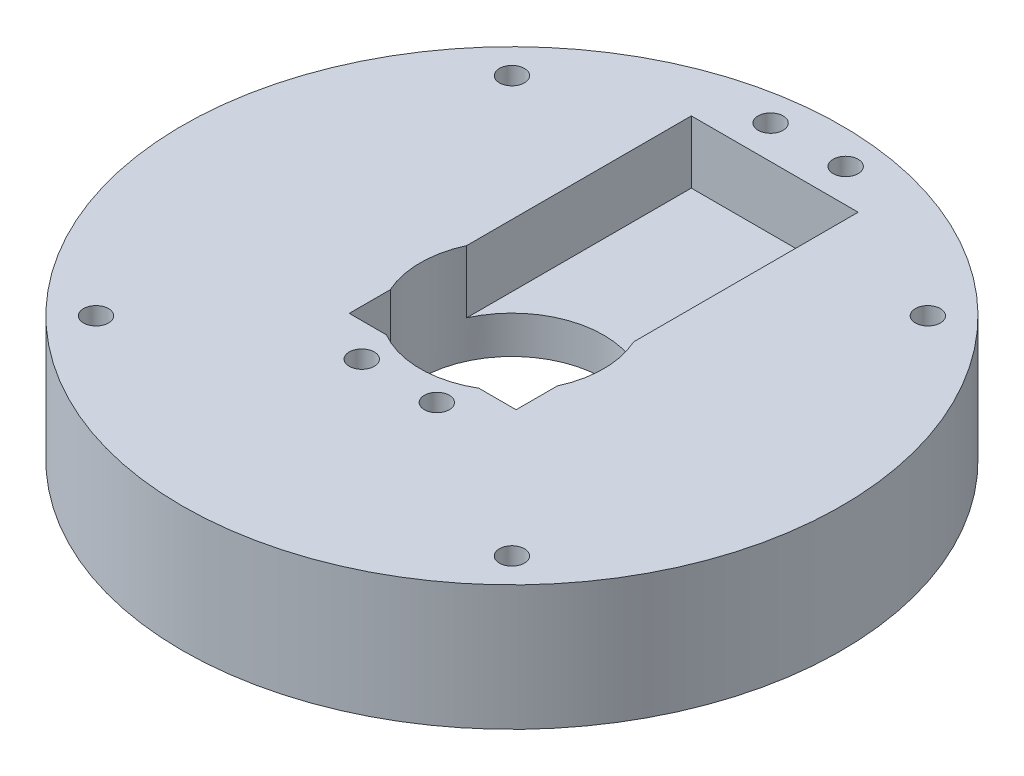
ISO-10303-21;
HEADER;
FILE_DESCRIPTION(('STEP AP214'),'2;1');
FILE_NAME('part.step','',(''),(''),'','','');
FILE_SCHEMA(('AUTOMOTIVE_DESIGN { 1 0 10303 214 1 1 1 1 }'));
ENDSEC;
DATA;
#1=APPLICATION_CONTEXT('core data for automotive mechanical design processes');
#2=APPLICATION_PROTOCOL_DEFINITION('international standard','automotive_design',2000,#1);
#3=PRODUCT_CONTEXT('',#1,'mechanical');
#4=PRODUCT('Part','Part','',(#3));
#5=PRODUCT_RELATED_PRODUCT_CATEGORY('part','',(#4));
#6=PRODUCT_DEFINITION_FORMATION('','',#4);
#7=PRODUCT_DEFINITION_CONTEXT('part definition',#1,'design');
#8=PRODUCT_DEFINITION('design','',#6,#7);
#9=PRODUCT_DEFINITION_SHAPE('','',#8);
#10=(LENGTH_UNIT() NAMED_UNIT(*) SI_UNIT(.MILLI.,.METRE.));
#11=(NAMED_UNIT(*) PLANE_ANGLE_UNIT() SI_UNIT($,.RADIAN.));
#12=(NAMED_UNIT(*) SI_UNIT($,.STERADIAN.) SOLID_ANGLE_UNIT());
#13=UNCERTAINTY_MEASURE_WITH_UNIT(LENGTH_MEASURE(1.E-05),#10,'distance_accuracy_value','');
#14=(GEOMETRIC_REPRESENTATION_CONTEXT(3) GLOBAL_UNCERTAINTY_ASSIGNED_CONTEXT((#13)) GLOBAL_UNIT_ASSIGNED_CONTEXT((#10,
#11,#12)) REPRESENTATION_CONTEXT('',''));
#15=CARTESIAN_POINT('',(0.,0.,0.));
#16=DIRECTION('',(0.,0.,1.));
#17=DIRECTION('',(1.,0.,0.));
#18=AXIS2_PLACEMENT_3D('',#15,#16,#17);
#19=CARTESIAN_POINT('',(0.,15.,0.));
#20=DIRECTION('',(0.,-1.,0.));
#21=DIRECTION('',(0.,0.,-1.));
#22=AXIS2_PLACEMENT_3D('',#19,#20,#21);
#23=CYLINDRICAL_SURFACE('',#22,11.);
#24=DIRECTION('',(0.,-1.,0.));
#25=VECTOR('',#24,1.);
#26=CARTESIAN_POINT('',(9.99999999999999,15.,4.58257569495585));
#27=LINE('',#26,#25);
#28=CARTESIAN_POINT('',(9.99999999999999,15.,4.58257569495585));
#29=VERTEX_POINT('',#28);
#30=CARTESIAN_POINT('',(9.99999999999999,7.5,4.58257569495585));
#31=VERTEX_POINT('',#30);
#32=EDGE_CURVE('E11',#29,#31,#27,.T.);
#33=ORIENTED_EDGE('',*,*,#32,.F.);
#34=CARTESIAN_POINT('',(0.,15.,0.));
#35=DIRECTION('',(0.,1.,0.));
#36=DIRECTION('',(0.,0.,1.));
#37=AXIS2_PLACEMENT_3D('',#34,#35,#36);
#38=CIRCLE('',#37,11.);
#39=CARTESIAN_POINT('',(9.99999999999999,15.,-4.58257569495585));
#40=VERTEX_POINT('',#39);
#41=EDGE_CURVE('E185',#29,#40,#38,.T.);
#42=ORIENTED_EDGE('',*,*,#41,.T.);
#43=DIRECTION('',(0.,-1.,0.));
#44=VECTOR('',#43,1.);
#45=CARTESIAN_POINT('',(9.99999999999999,15.,-4.58257569495585));
#46=LINE('',#45,#44);
#47=CARTESIAN_POINT('',(9.99999999999999,7.5,-4.58257569495585));
#48=VERTEX_POINT('',#47);
#49=EDGE_CURVE('E198',#48,#40,#46,.F.);
#50=ORIENTED_EDGE('',*,*,#49,.F.);
#51=CARTESIAN_POINT('',(0.,7.5,0.));
#52=DIRECTION('',(0.,-1.,0.));
#53=DIRECTION('',(0.,0.,-1.));
#54=AXIS2_PLACEMENT_3D('',#51,#52,#53);
#55=CIRCLE('',#54,11.);
#56=CARTESIAN_POINT('',(-10.,7.5,-4.58257569495583));
#57=VERTEX_POINT('',#56);
#58=EDGE_CURVE('E116',#57,#48,#55,.T.);
#59=ORIENTED_EDGE('',*,*,#58,.F.);
#60=DIRECTION('',(0.,-1.,0.));
#61=VECTOR('',#60,1.);
#62=CARTESIAN_POINT('',(-10.,15.,-4.58257569495583));
#63=LINE('',#62,#61);
#64=CARTESIAN_POINT('',(-10.,15.,-4.58257569495583));
#65=VERTEX_POINT('',#64);
#66=EDGE_CURVE('E193',#65,#57,#63,.T.);
#67=ORIENTED_EDGE('',*,*,#66,.F.);
#68=CARTESIAN_POINT('',(-10.,15.,4.58257569495583));
#69=VERTEX_POINT('',#68);
#70=EDGE_CURVE('E184',#65,#69,#38,.T.);
#71=ORIENTED_EDGE('',*,*,#70,.T.);
#72=DIRECTION('',(0.,-1.,0.));
#73=VECTOR('',#72,1.);
#74=CARTESIAN_POINT('',(-10.,15.,4.58257569495583));
#75=LINE('',#74,#73);
#76=CARTESIAN_POINT('',(-10.,7.5,4.58257569495583));
#77=VERTEX_POINT('',#76);
#78=EDGE_CURVE('E200',#77,#69,#75,.F.);
#79=ORIENTED_EDGE('',*,*,#78,.F.);
#80=CARTESIAN_POINT('',(-5.54526825320471,7.5,9.5));
#81=VERTEX_POINT('',#80);
#82=EDGE_CURVE('E195',#81,#77,#55,.T.);
#83=ORIENTED_EDGE('',*,*,#82,.F.);
#84=DIRECTION('',(0.,-1.,0.));
#85=VECTOR('',#84,1.);
#86=CARTESIAN_POINT('',(-5.54526825320471,15.,9.5));
#87=LINE('',#86,#85);
#88=CARTESIAN_POINT('',(-5.54526825320471,15.,9.5));
#89=VERTEX_POINT('',#88);
#90=EDGE_CURVE('E202',#89,#81,#87,.T.);
#91=ORIENTED_EDGE('',*,*,#90,.F.);
#92=CARTESIAN_POINT('',(5.54526825320471,15.,9.5));
#93=VERTEX_POINT('',#92);
#94=EDGE_CURVE('E179',#89,#93,#38,.T.);
#95=ORIENTED_EDGE('',*,*,#94,.T.);
#96=DIRECTION('',(0.,-1.,0.));
#97=VECTOR('',#96,1.);
#98=CARTESIAN_POINT('',(5.54526825320471,15.,9.5));
#99=LINE('',#98,#97);
#100=CARTESIAN_POINT('',(5.54526825320471,7.5,9.5));
#101=VERTEX_POINT('',#100);
#102=EDGE_CURVE('E42',#101,#93,#99,.F.);
#103=ORIENTED_EDGE('',*,*,#102,.F.);
#104=EDGE_CURVE('E194',#31,#101,#55,.T.);
#105=ORIENTED_EDGE('',*,*,#104,.F.);
#106=EDGE_LOOP('',(#33,#42,#50,#59,#67,#71,#79,#83,#91,#95,#103,#105));
#107=FACE_BOUND('',#106,.T.);
#108=CARTESIAN_POINT('',(0.,3.,0.));
#109=DIRECTION('',(0.,-1.,0.));
#110=DIRECTION('',(0.,0.,-1.));
#111=AXIS2_PLACEMENT_3D('',#108,#109,#110);
#112=CIRCLE('',#111,11.);
#113=CARTESIAN_POINT('',(0.,3.,-11.));
#114=VERTEX_POINT('',#113);
#115=EDGE_CURVE('E254',#114,#114,#112,.T.);
#116=ORIENTED_EDGE('',*,*,#115,.T.);
#117=EDGE_LOOP('',(#116));
#118=FACE_BOUND('',#117,.T.);
#119=ADVANCED_FACE('F33',(#107,#118),#23,.F.);
#120=CARTESIAN_POINT('',(-4.49999999999999,7.5,13.5));
#121=DIRECTION('',(0.,1.,0.));
#122=DIRECTION('',(0.,0.,1.));
#123=AXIS2_PLACEMENT_3D('',#120,#121,#122);
#124=CYLINDRICAL_SURFACE('',#123,1.5);
#125=CARTESIAN_POINT('',(-4.49999999999999,15.,13.5));
#126=DIRECTION('',(0.,1.,0.));
#127=DIRECTION('',(0.,0.,1.));
#128=AXIS2_PLACEMENT_3D('',#125,#126,#127);
#129=CIRCLE('',#128,1.5);
#130=CARTESIAN_POINT('',(-4.49999999999999,15.,15.));
#131=VERTEX_POINT('',#130);
#132=EDGE_CURVE('E231',#131,#131,#129,.T.);
#133=ORIENTED_EDGE('',*,*,#132,.T.);
#134=EDGE_LOOP('',(#133));
#135=FACE_BOUND('',#134,.T.);
#136=CARTESIAN_POINT('',(-4.49999999999999,3.,13.5));
#137=DIRECTION('',(0.,-1.,0.));
#138=DIRECTION('',(0.,0.,-1.));
#139=AXIS2_PLACEMENT_3D('',#136,#137,#138);
#140=CIRCLE('',#139,1.5);
#141=CARTESIAN_POINT('',(-4.49999999999999,3.,12.));
#142=VERTEX_POINT('',#141);
#143=EDGE_CURVE('E258',#142,#142,#140,.F.);
#144=ORIENTED_EDGE('',*,*,#143,.F.);
#145=EDGE_LOOP('',(#144));
#146=FACE_BOUND('',#145,.T.);
#147=ADVANCED_FACE('F278',(#135,#146),#124,.F.);
#148=CARTESIAN_POINT('',(4.5,7.5,13.5));
#149=DIRECTION('',(0.,1.,0.));
#150=DIRECTION('',(0.,0.,1.));
#151=AXIS2_PLACEMENT_3D('',#148,#149,#150);
#152=CYLINDRICAL_SURFACE('',#151,1.5);
#153=CARTESIAN_POINT('',(4.5,15.,13.5));
#154=DIRECTION('',(0.,1.,0.));
#155=DIRECTION('',(0.,0.,1.));
#156=AXIS2_PLACEMENT_3D('',#153,#154,#155);
#157=CIRCLE('',#156,1.5);
#158=CARTESIAN_POINT('',(4.5,15.,15.));
#159=VERTEX_POINT('',#158);
#160=EDGE_CURVE('E233',#159,#159,#157,.T.);
#161=ORIENTED_EDGE('',*,*,#160,.T.);
#162=EDGE_LOOP('',(#161));
#163=FACE_BOUND('',#162,.T.);
#164=CARTESIAN_POINT('',(4.5,3.,13.5));
#165=DIRECTION('',(0.,-1.,0.));
#166=DIRECTION('',(0.,0.,-1.));
#167=AXIS2_PLACEMENT_3D('',#164,#165,#166);
#168=CIRCLE('',#167,1.5);
#169=CARTESIAN_POINT('',(4.5,3.,12.));
#170=VERTEX_POINT('',#169);
#171=EDGE_CURVE('E37',#170,#170,#168,.F.);
#172=ORIENTED_EDGE('',*,*,#171,.F.);
#173=EDGE_LOOP('',(#172));
#174=FACE_BOUND('',#173,.T.);
#175=ADVANCED_FACE('F276',(#163,#174),#152,.F.);
#176=CARTESIAN_POINT('',(0.,15.,0.));
#177=DIRECTION('',(0.,1.,0.));
#178=DIRECTION('',(0.,0.,1.));
#179=AXIS2_PLACEMENT_3D('',#176,#177,#178);
#180=PLANE('',#179);
#181=CARTESIAN_POINT('',(-4.5,15.,-35.5));
#182=DIRECTION('',(0.,1.,0.));
#183=DIRECTION('',(0.,0.,1.));
#184=AXIS2_PLACEMENT_3D('',#181,#182,#183);
#185=CIRCLE('',#184,1.5);
#186=CARTESIAN_POINT('',(-4.5,15.,-34.));
#187=VERTEX_POINT('',#186);
#188=EDGE_CURVE('E245',#187,#187,#185,.T.);
#189=ORIENTED_EDGE('',*,*,#188,.F.);
#190=EDGE_LOOP('',(#189));
#191=FACE_BOUND('',#190,.T.);
#192=CARTESIAN_POINT('',(4.5,15.,-35.5));
#193=DIRECTION('',(0.,1.,0.));
#194=DIRECTION('',(0.,0.,1.));
#195=AXIS2_PLACEMENT_3D('',#192,#193,#194);
#196=CIRCLE('',#195,1.5);
#197=CARTESIAN_POINT('',(4.5,15.,-34.));
#198=VERTEX_POINT('',#197);
#199=EDGE_CURVE('E238',#198,#198,#196,.T.);
#200=ORIENTED_EDGE('',*,*,#199,.F.);
#201=EDGE_LOOP('',(#200));
#202=FACE_BOUND('',#201,.T.);
#203=ORIENTED_EDGE('',*,*,#160,.F.);
#204=EDGE_LOOP('',(#203));
#205=FACE_BOUND('',#204,.T.);
#206=ORIENTED_EDGE('',*,*,#132,.F.);
#207=EDGE_LOOP('',(#206));
#208=FACE_BOUND('',#207,.T.);
#209=DIRECTION('',(0.,0.,-1.));
#210=VECTOR('',#209,1.);
#211=CARTESIAN_POINT('',(9.99999999999999,15.,9.5));
#212=LINE('',#211,#210);
#213=CARTESIAN_POINT('',(9.99999999999999,15.,9.5));
#214=VERTEX_POINT('',#213);
#215=EDGE_CURVE('E141',#214,#29,#212,.T.);
#216=ORIENTED_EDGE('',*,*,#215,.F.);
#217=DIRECTION('',(1.,0.,0.));
#218=VECTOR('',#217,1.);
#219=CARTESIAN_POINT('',(-10.,15.,9.5));
#220=LINE('',#219,#218);
#221=EDGE_CURVE('E148',#93,#214,#220,.T.);
#222=ORIENTED_EDGE('',*,*,#221,.F.);
#223=ORIENTED_EDGE('',*,*,#94,.F.);
#224=CARTESIAN_POINT('',(-10.,15.,9.5));
#225=VERTEX_POINT('',#224);
#226=EDGE_CURVE('E119',#225,#89,#220,.T.);
#227=ORIENTED_EDGE('',*,*,#226,.F.);
#228=DIRECTION('',(0.,0.,1.));
#229=VECTOR('',#228,1.);
#230=CARTESIAN_POINT('',(-10.,15.,9.5));
#231=LINE('',#230,#229);
#232=EDGE_CURVE('E145',#69,#225,#231,.T.);
#233=ORIENTED_EDGE('',*,*,#232,.F.);
#234=ORIENTED_EDGE('',*,*,#70,.F.);
#235=CARTESIAN_POINT('',(-10.,15.,-31.5));
#236=VERTEX_POINT('',#235);
#237=EDGE_CURVE('E146',#236,#65,#231,.T.);
#238=ORIENTED_EDGE('',*,*,#237,.F.);
#239=DIRECTION('',(-1.,0.,0.));
#240=VECTOR('',#239,1.);
#241=CARTESIAN_POINT('',(-10.,15.,-31.5));
#242=LINE('',#241,#240);
#243=CARTESIAN_POINT('',(9.99999999999999,15.,-31.5));
#244=VERTEX_POINT('',#243);
#245=EDGE_CURVE('E143',#244,#236,#242,.T.);
#246=ORIENTED_EDGE('',*,*,#245,.F.);
#247=EDGE_CURVE('E125',#40,#244,#212,.T.);
#248=ORIENTED_EDGE('',*,*,#247,.F.);
#249=ORIENTED_EDGE('',*,*,#41,.F.);
#250=EDGE_LOOP('',(#216,#222,#223,#227,#233,#234,#238,#246,#248,#249));
#251=FACE_BOUND('',#250,.T.);
#252=CARTESIAN_POINT('',(-24.9255140368244,15.,24.9255140368272));
#253=DIRECTION('',(0.,1.,0.));
#254=DIRECTION('',(0.,0.,1.));
#255=AXIS2_PLACEMENT_3D('',#252,#253,#254);
#256=CIRCLE('',#255,1.50000000000104);
#257=CARTESIAN_POINT('',(-24.9255140368244,15.,26.4255140368283));
#258=VERTEX_POINT('',#257);
#259=EDGE_CURVE('E164',#258,#258,#256,.T.);
#260=ORIENTED_EDGE('',*,*,#259,.F.);
#261=EDGE_LOOP('',(#260));
#262=FACE_BOUND('',#261,.T.);
#263=CARTESIAN_POINT('',(24.9255140368257,15.,-24.9255140368258));
#264=DIRECTION('',(0.,1.,0.));
#265=DIRECTION('',(0.,0.,1.));
#266=AXIS2_PLACEMENT_3D('',#263,#264,#265);
#267=CIRCLE('',#266,1.5);
#268=CARTESIAN_POINT('',(24.9255140368257,15.,-23.4255140368258));
#269=VERTEX_POINT('',#268);
#270=EDGE_CURVE('E176',#269,#269,#267,.T.);
#271=ORIENTED_EDGE('',*,*,#270,.F.);
#272=EDGE_LOOP('',(#271));
#273=FACE_BOUND('',#272,.T.);
#274=CARTESIAN_POINT('',(0.,15.,0.));
#275=DIRECTION('',(0.,1.,0.));
#276=DIRECTION('',(0.,0.,1.));
#277=AXIS2_PLACEMENT_3D('',#274,#275,#276);
#278=CIRCLE('',#277,39.5);
#279=CARTESIAN_POINT('',(0.,15.,39.5));
#280=VERTEX_POINT('',#279);
#281=EDGE_CURVE('E186',#280,#280,#278,.T.);
#282=ORIENTED_EDGE('',*,*,#281,.T.);
#283=EDGE_LOOP('',(#282));
#284=FACE_BOUND('',#283,.T.);
#285=CARTESIAN_POINT('',(24.9255140368272,15.,24.9255140368257));
#286=DIRECTION('',(0.,1.,0.));
#287=DIRECTION('',(0.,0.,1.));
#288=AXIS2_PLACEMENT_3D('',#285,#286,#287);
#289=CIRCLE('',#288,1.49999999999966);
#290=CARTESIAN_POINT('',(24.9255140368272,15.,26.4255140368254));
#291=VERTEX_POINT('',#290);
#292=EDGE_CURVE('E170',#291,#291,#289,.T.);
#293=ORIENTED_EDGE('',*,*,#292,.F.);
#294=EDGE_LOOP('',(#293));
#295=FACE_BOUND('',#294,.T.);
#296=CARTESIAN_POINT('',(-24.9255140368258,15.,-24.9255140368244));
#297=DIRECTION('',(0.,1.,0.));
#298=DIRECTION('',(0.,0.,1.));
#299=AXIS2_PLACEMENT_3D('',#296,#297,#298);
#300=CIRCLE('',#299,1.5000000000015);
#301=CARTESIAN_POINT('',(-24.9255140368258,15.,-23.4255140368229));
#302=VERTEX_POINT('',#301);
#303=EDGE_CURVE('E158',#302,#302,#300,.T.);
#304=ORIENTED_EDGE('',*,*,#303,.F.);
#305=EDGE_LOOP('',(#304));
#306=FACE_BOUND('',#305,.T.);
#307=ADVANCED_FACE('F229',(#191,#202,#205,#208,#251,#262,#273,#284,#295,#306),#180,.T.);
#308=CARTESIAN_POINT('',(0.,0.,0.));
#309=DIRECTION('',(0.,1.,0.));
#310=DIRECTION('',(0.,0.,1.));
#311=AXIS2_PLACEMENT_3D('',#308,#309,#310);
#312=PLANE('',#311);
#313=CARTESIAN_POINT('',(0.,0.,0.));
#314=DIRECTION('',(0.,-1.,0.));
#315=DIRECTION('',(0.,0.,-1.));
#316=AXIS2_PLACEMENT_3D('',#313,#314,#315);
#317=CIRCLE('',#316,25.);
#318=CARTESIAN_POINT('',(0.,0.,-25.));
#319=VERTEX_POINT('',#318);
#320=EDGE_CURVE('E263',#319,#319,#317,.T.);
#321=ORIENTED_EDGE('',*,*,#320,.F.);
#322=EDGE_LOOP('',(#321));
#323=FACE_BOUND('',#322,.T.);
#324=CARTESIAN_POINT('',(4.5,0.,-35.5));
#325=DIRECTION('',(0.,1.,0.));
#326=DIRECTION('',(0.,0.,1.));
#327=AXIS2_PLACEMENT_3D('',#324,#325,#326);
#328=CIRCLE('',#327,1.5);
#329=CARTESIAN_POINT('',(4.5,0.,-34.));
#330=VERTEX_POINT('',#329);
#331=EDGE_CURVE('E250',#330,#330,#328,.T.);
#332=ORIENTED_EDGE('',*,*,#331,.T.);
#333=EDGE_LOOP('',(#332));
#334=FACE_BOUND('',#333,.T.);
#335=CARTESIAN_POINT('',(-4.5,0.,-35.5));
#336=DIRECTION('',(0.,1.,0.));
#337=DIRECTION('',(0.,0.,1.));
#338=AXIS2_PLACEMENT_3D('',#335,#336,#337);
#339=CIRCLE('',#338,1.5);
#340=CARTESIAN_POINT('',(-4.5,0.,-34.));
#341=VERTEX_POINT('',#340);
#342=EDGE_CURVE('E241',#341,#341,#339,.T.);
#343=ORIENTED_EDGE('',*,*,#342,.T.);
#344=EDGE_LOOP('',(#343));
#345=FACE_BOUND('',#344,.T.);
#346=CARTESIAN_POINT('',(0.,0.,0.));
#347=DIRECTION('',(0.,1.,0.));
#348=DIRECTION('',(0.,0.,1.));
#349=AXIS2_PLACEMENT_3D('',#346,#347,#348);
#350=CIRCLE('',#349,39.5);
#351=CARTESIAN_POINT('',(0.,0.,39.5));
#352=VERTEX_POINT('',#351);
#353=EDGE_CURVE('E189',#352,#352,#350,.T.);
#354=ORIENTED_EDGE('',*,*,#353,.F.);
#355=EDGE_LOOP('',(#354));
#356=FACE_BOUND('',#355,.T.);
#357=CARTESIAN_POINT('',(24.9255140368257,0.,-24.9255140368258));
#358=DIRECTION('',(0.,1.,0.));
#359=DIRECTION('',(0.,0.,1.));
#360=AXIS2_PLACEMENT_3D('',#357,#358,#359);
#361=CIRCLE('',#360,1.5);
#362=CARTESIAN_POINT('',(24.9255140368257,0.,-23.4255140368258));
#363=VERTEX_POINT('',#362);
#364=EDGE_CURVE('E173',#363,#363,#361,.T.);
#365=ORIENTED_EDGE('',*,*,#364,.T.);
#366=EDGE_LOOP('',(#365));
#367=FACE_BOUND('',#366,.T.);
#368=CARTESIAN_POINT('',(24.9255140368272,0.,24.9255140368257));
#369=DIRECTION('',(0.,1.,0.));
#370=DIRECTION('',(0.,0.,1.));
#371=AXIS2_PLACEMENT_3D('',#368,#369,#370);
#372=CIRCLE('',#371,1.49999999999966);
#373=CARTESIAN_POINT('',(24.9255140368272,0.,26.4255140368254));
#374=VERTEX_POINT('',#373);
#375=EDGE_CURVE('E167',#374,#374,#372,.T.);
#376=ORIENTED_EDGE('',*,*,#375,.T.);
#377=EDGE_LOOP('',(#376));
#378=FACE_BOUND('',#377,.T.);
#379=CARTESIAN_POINT('',(-24.9255140368244,0.,24.9255140368272));
#380=DIRECTION('',(0.,1.,0.));
#381=DIRECTION('',(0.,0.,1.));
#382=AXIS2_PLACEMENT_3D('',#379,#380,#381);
#383=CIRCLE('',#382,1.50000000000104);
#384=CARTESIAN_POINT('',(-24.9255140368244,0.,26.4255140368283));
#385=VERTEX_POINT('',#384);
#386=EDGE_CURVE('E161',#385,#385,#383,.T.);
#387=ORIENTED_EDGE('',*,*,#386,.T.);
#388=EDGE_LOOP('',(#387));
#389=FACE_BOUND('',#388,.T.);
#390=CARTESIAN_POINT('',(-24.9255140368258,0.,-24.9255140368244));
#391=DIRECTION('',(0.,1.,0.));
#392=DIRECTION('',(0.,0.,1.));
#393=AXIS2_PLACEMENT_3D('',#390,#391,#392);
#394=CIRCLE('',#393,1.5000000000015);
#395=CARTESIAN_POINT('',(-24.9255140368258,0.,-23.4255140368229));
#396=VERTEX_POINT('',#395);
#397=EDGE_CURVE('E153',#396,#396,#394,.T.);
#398=ORIENTED_EDGE('',*,*,#397,.T.);
#399=EDGE_LOOP('',(#398));
#400=FACE_BOUND('',#399,.T.);
#401=ADVANCED_FACE('F285',(#323,#334,#345,#356,#367,#378,#389,#400),#312,.F.);
#402=CARTESIAN_POINT('',(0.,15.,0.));
#403=DIRECTION('',(0.,-1.,0.));
#404=DIRECTION('',(0.,0.,-1.));
#405=AXIS2_PLACEMENT_3D('',#402,#403,#404);
#406=CYLINDRICAL_SURFACE('',#405,39.5);
#407=ORIENTED_EDGE('',*,*,#281,.F.);
#408=EDGE_LOOP('',(#407));
#409=FACE_BOUND('',#408,.T.);
#410=ORIENTED_EDGE('',*,*,#353,.T.);
#411=EDGE_LOOP('',(#410));
#412=FACE_BOUND('',#411,.T.);
#413=ADVANCED_FACE('F35',(#409,#412),#406,.T.);
#414=CARTESIAN_POINT('',(24.9255140368257,15.,-24.9255140368258));
#415=DIRECTION('',(0.,-1.,0.));
#416=DIRECTION('',(0.,0.,-1.));
#417=AXIS2_PLACEMENT_3D('',#414,#415,#416);
#418=CYLINDRICAL_SURFACE('',#417,1.5);
#419=ORIENTED_EDGE('',*,*,#270,.T.);
#420=EDGE_LOOP('',(#419));
#421=FACE_BOUND('',#420,.T.);
#422=ORIENTED_EDGE('',*,*,#364,.F.);
#423=EDGE_LOOP('',(#422));
#424=FACE_BOUND('',#423,.T.);
#425=ADVANCED_FACE('F295',(#421,#424),#418,.F.);
#426=CARTESIAN_POINT('',(24.9255140368272,15.,24.9255140368257));
#427=DIRECTION('',(0.,-1.,0.));
#428=DIRECTION('',(0.,0.,-1.));
#429=AXIS2_PLACEMENT_3D('',#426,#427,#428);
#430=CYLINDRICAL_SURFACE('',#429,1.49999999999966);
#431=ORIENTED_EDGE('',*,*,#292,.T.);
#432=EDGE_LOOP('',(#431));
#433=FACE_BOUND('',#432,.T.);
#434=ORIENTED_EDGE('',*,*,#375,.F.);
#435=EDGE_LOOP('',(#434));
#436=FACE_BOUND('',#435,.T.);
#437=ADVANCED_FACE('F327',(#433,#436),#430,.F.);
#438=CARTESIAN_POINT('',(-24.9255140368244,15.,24.9255140368272));
#439=DIRECTION('',(0.,-1.,0.));
#440=DIRECTION('',(0.,0.,-1.));
#441=AXIS2_PLACEMENT_3D('',#438,#439,#440);
#442=CYLINDRICAL_SURFACE('',#441,1.50000000000104);
#443=ORIENTED_EDGE('',*,*,#259,.T.);
#444=EDGE_LOOP('',(#443));
#445=FACE_BOUND('',#444,.T.);
#446=ORIENTED_EDGE('',*,*,#386,.F.);
#447=EDGE_LOOP('',(#446));
#448=FACE_BOUND('',#447,.T.);
#449=ADVANCED_FACE('F317',(#445,#448),#442,.F.);
#450=CARTESIAN_POINT('',(-24.9255140368258,15.,-24.9255140368244));
#451=DIRECTION('',(0.,-1.,0.));
#452=DIRECTION('',(0.,0.,-1.));
#453=AXIS2_PLACEMENT_3D('',#450,#451,#452);
#454=CYLINDRICAL_SURFACE('',#453,1.5000000000015);
#455=ORIENTED_EDGE('',*,*,#303,.T.);
#456=EDGE_LOOP('',(#455));
#457=FACE_BOUND('',#456,.T.);
#458=ORIENTED_EDGE('',*,*,#397,.F.);
#459=EDGE_LOOP('',(#458));
#460=FACE_BOUND('',#459,.T.);
#461=ADVANCED_FACE('F315',(#457,#460),#454,.F.);
#462=CARTESIAN_POINT('',(0.,7.5,0.));
#463=DIRECTION('',(0.,-1.,0.));
#464=DIRECTION('',(0.,0.,-1.));
#465=AXIS2_PLACEMENT_3D('',#462,#463,#464);
#466=PLANE('',#465);
#467=ORIENTED_EDGE('',*,*,#58,.T.);
#468=DIRECTION('',(0.,0.,-1.));
#469=VECTOR('',#468,1.);
#470=CARTESIAN_POINT('',(9.99999999999999,7.5,9.5));
#471=LINE('',#470,#469);
#472=CARTESIAN_POINT('',(9.99999999999999,7.5,-31.5));
#473=VERTEX_POINT('',#472);
#474=EDGE_CURVE('E110',#48,#473,#471,.T.);
#475=ORIENTED_EDGE('',*,*,#474,.T.);
#476=DIRECTION('',(-1.,0.,0.));
#477=VECTOR('',#476,1.);
#478=CARTESIAN_POINT('',(-10.,7.5,-31.5));
#479=LINE('',#478,#477);
#480=CARTESIAN_POINT('',(-10.,7.5,-31.5));
#481=VERTEX_POINT('',#480);
#482=EDGE_CURVE('E114',#473,#481,#479,.T.);
#483=ORIENTED_EDGE('',*,*,#482,.T.);
#484=DIRECTION('',(0.,0.,1.));
#485=VECTOR('',#484,1.);
#486=CARTESIAN_POINT('',(-10.,7.5,9.5));
#487=LINE('',#486,#485);
#488=EDGE_CURVE('E135',#481,#57,#487,.T.);
#489=ORIENTED_EDGE('',*,*,#488,.T.);
#490=EDGE_LOOP('',(#467,#475,#483,#489));
#491=FACE_BOUND('',#490,.T.);
#492=ADVANCED_FACE('F112',(#491),#466,.F.);
#493=CARTESIAN_POINT('',(-10.,7.5,9.5));
#494=DIRECTION('',(-1.,0.,0.));
#495=DIRECTION('',(0.,0.,1.));
#496=AXIS2_PLACEMENT_3D('',#493,#494,#495);
#497=PLANE('',#496);
#498=ORIENTED_EDGE('',*,*,#66,.T.);
#499=ORIENTED_EDGE('',*,*,#488,.F.);
#500=DIRECTION('',(0.,1.,0.));
#501=VECTOR('',#500,1.);
#502=CARTESIAN_POINT('',(-10.,7.5,-31.5));
#503=LINE('',#502,#501);
#504=EDGE_CURVE('E129',#481,#236,#503,.T.);
#505=ORIENTED_EDGE('',*,*,#504,.T.);
#506=ORIENTED_EDGE('',*,*,#237,.T.);
#507=EDGE_LOOP('',(#498,#499,#505,#506));
#508=FACE_BOUND('',#507,.T.);
#509=ADVANCED_FACE('F324',(#508),#497,.F.);
#510=CARTESIAN_POINT('',(9.99999999999999,7.5,9.5));
#511=DIRECTION('',(1.,0.,0.));
#512=DIRECTION('',(0.,0.,-1.));
#513=AXIS2_PLACEMENT_3D('',#510,#511,#512);
#514=PLANE('',#513);
#515=ORIENTED_EDGE('',*,*,#49,.T.);
#516=ORIENTED_EDGE('',*,*,#247,.T.);
#517=DIRECTION('',(0.,1.,0.));
#518=VECTOR('',#517,1.);
#519=CARTESIAN_POINT('',(9.99999999999999,7.5,-31.5));
#520=LINE('',#519,#518);
#521=EDGE_CURVE('E122',#473,#244,#520,.T.);
#522=ORIENTED_EDGE('',*,*,#521,.F.);
#523=ORIENTED_EDGE('',*,*,#474,.F.);
#524=EDGE_LOOP('',(#515,#516,#522,#523));
#525=FACE_BOUND('',#524,.T.);
#526=ADVANCED_FACE('F123',(#525),#514,.F.);
#527=CARTESIAN_POINT('',(-10.,7.5,-31.5));
#528=DIRECTION('',(0.,0.,-1.));
#529=DIRECTION('',(-1.,0.,0.));
#530=AXIS2_PLACEMENT_3D('',#527,#528,#529);
#531=PLANE('',#530);
#532=ORIENTED_EDGE('',*,*,#245,.T.);
#533=ORIENTED_EDGE('',*,*,#504,.F.);
#534=ORIENTED_EDGE('',*,*,#482,.F.);
#535=ORIENTED_EDGE('',*,*,#521,.T.);
#536=EDGE_LOOP('',(#532,#533,#534,#535));
#537=FACE_BOUND('',#536,.T.);
#538=ADVANCED_FACE('F131',(#537),#531,.F.);
#539=ORIENTED_EDGE('',*,*,#82,.T.);
#540=CARTESIAN_POINT('',(-10.,7.5,9.5));
#541=VERTEX_POINT('',#540);
#542=EDGE_CURVE('E133',#77,#541,#487,.T.);
#543=ORIENTED_EDGE('',*,*,#542,.T.);
#544=DIRECTION('',(1.,0.,0.));
#545=VECTOR('',#544,1.);
#546=CARTESIAN_POINT('',(-10.,7.5,9.5));
#547=LINE('',#546,#545);
#548=EDGE_CURVE('E56',#541,#81,#547,.T.);
#549=ORIENTED_EDGE('',*,*,#548,.T.);
#550=EDGE_LOOP('',(#539,#543,#549));
#551=FACE_BOUND('',#550,.T.);
#552=ADVANCED_FACE('F211',(#551),#466,.F.);
#553=ORIENTED_EDGE('',*,*,#78,.T.);
#554=ORIENTED_EDGE('',*,*,#232,.T.);
#555=DIRECTION('',(0.,1.,0.));
#556=VECTOR('',#555,1.);
#557=CARTESIAN_POINT('',(-10.,7.5,9.5));
#558=LINE('',#557,#556);
#559=EDGE_CURVE('E154',#541,#225,#558,.T.);
#560=ORIENTED_EDGE('',*,*,#559,.F.);
#561=ORIENTED_EDGE('',*,*,#542,.F.);
#562=EDGE_LOOP('',(#553,#554,#560,#561));
#563=FACE_BOUND('',#562,.T.);
#564=ADVANCED_FACE('F217',(#563),#497,.F.);
#565=CARTESIAN_POINT('',(-10.,7.5,9.5));
#566=DIRECTION('',(0.,0.,1.));
#567=DIRECTION('',(1.,0.,0.));
#568=AXIS2_PLACEMENT_3D('',#565,#566,#567);
#569=PLANE('',#568);
#570=ORIENTED_EDGE('',*,*,#90,.T.);
#571=ORIENTED_EDGE('',*,*,#548,.F.);
#572=ORIENTED_EDGE('',*,*,#559,.T.);
#573=ORIENTED_EDGE('',*,*,#226,.T.);
#574=EDGE_LOOP('',(#570,#571,#572,#573));
#575=FACE_BOUND('',#574,.T.);
#576=ADVANCED_FACE('F417',(#575),#569,.F.);
#577=ORIENTED_EDGE('',*,*,#32,.T.);
#578=CARTESIAN_POINT('',(9.99999999999999,7.5,9.5));
#579=VERTEX_POINT('',#578);
#580=EDGE_CURVE('E49',#579,#31,#471,.T.);
#581=ORIENTED_EDGE('',*,*,#580,.F.);
#582=DIRECTION('',(0.,1.,0.));
#583=VECTOR('',#582,1.);
#584=CARTESIAN_POINT('',(9.99999999999999,7.5,9.5));
#585=LINE('',#584,#583);
#586=EDGE_CURVE('E150',#579,#214,#585,.T.);
#587=ORIENTED_EDGE('',*,*,#586,.T.);
#588=ORIENTED_EDGE('',*,*,#215,.T.);
#589=EDGE_LOOP('',(#577,#581,#587,#588));
#590=FACE_BOUND('',#589,.T.);
#591=ADVANCED_FACE('F398',(#590),#514,.F.);
#592=ORIENTED_EDGE('',*,*,#104,.T.);
#593=EDGE_CURVE('E139',#101,#579,#547,.T.);
#594=ORIENTED_EDGE('',*,*,#593,.T.);
#595=ORIENTED_EDGE('',*,*,#580,.T.);
#596=EDGE_LOOP('',(#592,#594,#595));
#597=FACE_BOUND('',#596,.T.);
#598=ADVANCED_FACE('F326',(#597),#466,.F.);
#599=ORIENTED_EDGE('',*,*,#102,.T.);
#600=ORIENTED_EDGE('',*,*,#221,.T.);
#601=ORIENTED_EDGE('',*,*,#586,.F.);
#602=ORIENTED_EDGE('',*,*,#593,.F.);
#603=EDGE_LOOP('',(#599,#600,#601,#602));
#604=FACE_BOUND('',#603,.T.);
#605=ADVANCED_FACE('F426',(#604),#569,.F.);
#606=CARTESIAN_POINT('',(4.5,7.5,-35.5));
#607=DIRECTION('',(0.,1.,0.));
#608=DIRECTION('',(0.,0.,1.));
#609=AXIS2_PLACEMENT_3D('',#606,#607,#608);
#610=CYLINDRICAL_SURFACE('',#609,1.5);
#611=ORIENTED_EDGE('',*,*,#199,.T.);
#612=EDGE_LOOP('',(#611));
#613=FACE_BOUND('',#612,.T.);
#614=ORIENTED_EDGE('',*,*,#331,.F.);
#615=EDGE_LOOP('',(#614));
#616=FACE_BOUND('',#615,.T.);
#617=ADVANCED_FACE('F446',(#613,#616),#610,.F.);
#618=CARTESIAN_POINT('',(-4.5,7.5,-35.5));
#619=DIRECTION('',(0.,1.,0.));
#620=DIRECTION('',(0.,0.,1.));
#621=AXIS2_PLACEMENT_3D('',#618,#619,#620);
#622=CYLINDRICAL_SURFACE('',#621,1.5);
#623=ORIENTED_EDGE('',*,*,#188,.T.);
#624=EDGE_LOOP('',(#623));
#625=FACE_BOUND('',#624,.T.);
#626=ORIENTED_EDGE('',*,*,#342,.F.);
#627=EDGE_LOOP('',(#626));
#628=FACE_BOUND('',#627,.T.);
#629=ADVANCED_FACE('F454',(#625,#628),#622,.F.);
#630=CARTESIAN_POINT('',(0.,3.,0.));
#631=DIRECTION('',(0.,-1.,0.));
#632=DIRECTION('',(0.,0.,-1.));
#633=AXIS2_PLACEMENT_3D('',#630,#631,#632);
#634=PLANE('',#633);
#635=ORIENTED_EDGE('',*,*,#115,.F.);
#636=EDGE_LOOP('',(#635));
#637=FACE_BOUND('',#636,.T.);
#638=CARTESIAN_POINT('',(0.,3.,0.));
#639=DIRECTION('',(0.,-1.,0.));
#640=DIRECTION('',(0.,0.,-1.));
#641=AXIS2_PLACEMENT_3D('',#638,#639,#640);
#642=CIRCLE('',#641,25.);
#643=CARTESIAN_POINT('',(0.,3.,-25.));
#644=VERTEX_POINT('',#643);
#645=EDGE_CURVE('E266',#644,#644,#642,.T.);
#646=ORIENTED_EDGE('',*,*,#645,.T.);
#647=EDGE_LOOP('',(#646));
#648=FACE_BOUND('',#647,.T.);
#649=ORIENTED_EDGE('',*,*,#171,.T.);
#650=EDGE_LOOP('',(#649));
#651=FACE_BOUND('',#650,.T.);
#652=ORIENTED_EDGE('',*,*,#143,.T.);
#653=EDGE_LOOP('',(#652));
#654=FACE_BOUND('',#653,.T.);
#655=ADVANCED_FACE('F273',(#637,#648,#651,#654),#634,.T.);
#656=CARTESIAN_POINT('',(0.,3.,0.));
#657=DIRECTION('',(0.,-1.,0.));
#658=DIRECTION('',(0.,0.,-1.));
#659=AXIS2_PLACEMENT_3D('',#656,#657,#658);
#660=CYLINDRICAL_SURFACE('',#659,25.);
#661=ORIENTED_EDGE('',*,*,#645,.F.);
#662=EDGE_LOOP('',(#661));
#663=FACE_BOUND('',#662,.T.);
#664=ORIENTED_EDGE('',*,*,#320,.T.);
#665=EDGE_LOOP('',(#664));
#666=FACE_BOUND('',#665,.T.);
#667=ADVANCED_FACE('F492',(#663,#666),#660,.F.);
#668=CLOSED_SHELL('',(#119,#147,#175,#307,#401,#413,#425,#437,#449,#461,#492,#509,#526,#538,
#552,#564,#576,#591,#598,#605,#617,#629,#655,#667));
#669=MANIFOLD_SOLID_BREP('B2',#668);
#670=ADVANCED_BREP_SHAPE_REPRESENTATION('',(#18,#669),#14);
#671=SHAPE_DEFINITION_REPRESENTATION(#9,#670);
ENDSEC;
END-ISO-10303-21;
